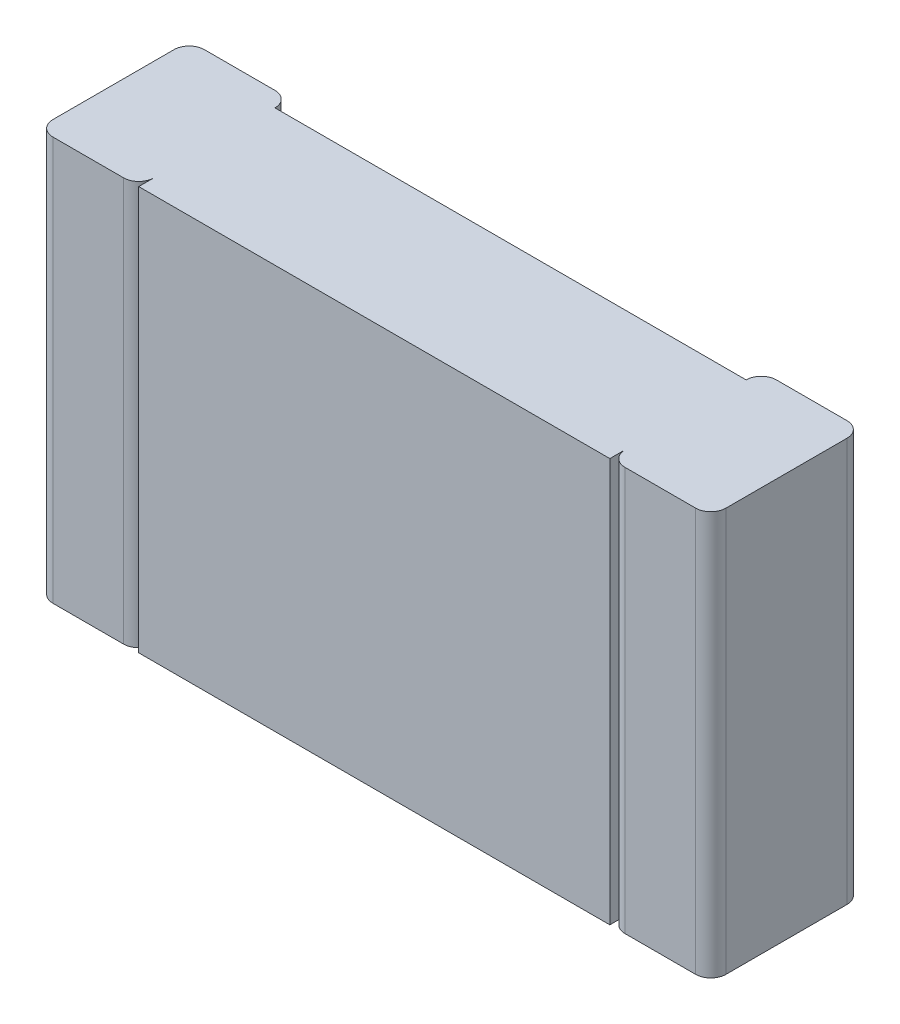
ISO-10303-21;
HEADER;
FILE_DESCRIPTION(('STEP AP214'),'2;1');
FILE_NAME('part.step','',(''),(''),'','','');
FILE_SCHEMA(('AUTOMOTIVE_DESIGN { 1 0 10303 214 1 1 1 1 }'));
ENDSEC;
DATA;
#1=APPLICATION_CONTEXT('core data for automotive mechanical design processes');
#2=APPLICATION_PROTOCOL_DEFINITION('international standard','automotive_design',2000,#1);
#3=PRODUCT_CONTEXT('',#1,'mechanical');
#4=PRODUCT('Part','Part','',(#3));
#5=PRODUCT_RELATED_PRODUCT_CATEGORY('part','',(#4));
#6=PRODUCT_DEFINITION_FORMATION('','',#4);
#7=PRODUCT_DEFINITION_CONTEXT('part definition',#1,'design');
#8=PRODUCT_DEFINITION('design','',#6,#7);
#9=PRODUCT_DEFINITION_SHAPE('','',#8);
#10=(LENGTH_UNIT() NAMED_UNIT(*) SI_UNIT(.MILLI.,.METRE.));
#11=(NAMED_UNIT(*) PLANE_ANGLE_UNIT() SI_UNIT($,.RADIAN.));
#12=(NAMED_UNIT(*) SI_UNIT($,.STERADIAN.) SOLID_ANGLE_UNIT());
#13=UNCERTAINTY_MEASURE_WITH_UNIT(LENGTH_MEASURE(1.E-05),#10,'distance_accuracy_value','');
#14=(GEOMETRIC_REPRESENTATION_CONTEXT(3) GLOBAL_UNCERTAINTY_ASSIGNED_CONTEXT((#13)) GLOBAL_UNIT_ASSIGNED_CONTEXT((#10,
#11,#12)) REPRESENTATION_CONTEXT('',''));
#15=CARTESIAN_POINT('',(0.,0.,0.));
#16=DIRECTION('',(0.,0.,1.));
#17=DIRECTION('',(1.,0.,0.));
#18=AXIS2_PLACEMENT_3D('',#15,#16,#17);
#19=CARTESIAN_POINT('',(-0.7,-0.6,0.405));
#20=DIRECTION('',(1.,0.,0.));
#21=DIRECTION('',(0.,0.,-1.));
#22=AXIS2_PLACEMENT_3D('',#19,#20,#21);
#23=PLANE('',#22);
#24=DIRECTION('',(0.,0.,-1.));
#25=VECTOR('',#24,1.);
#26=CARTESIAN_POINT('',(-0.7,0.6,0.405));
#27=LINE('',#26,#25);
#28=CARTESIAN_POINT('',(-0.7,0.6,0.405));
#29=VERTEX_POINT('',#28);
#30=CARTESIAN_POINT('',(-0.7,0.6,0.45));
#31=VERTEX_POINT('',#30);
#32=EDGE_CURVE('E197',#29,#31,#27,.F.);
#33=ORIENTED_EDGE('',*,*,#32,.F.);
#34=DIRECTION('',(0.,1.,0.));
#35=VECTOR('',#34,1.);
#36=CARTESIAN_POINT('',(-0.7,-0.6,0.405));
#37=LINE('',#36,#35);
#38=CARTESIAN_POINT('',(-0.7,-0.6,0.405));
#39=VERTEX_POINT('',#38);
#40=EDGE_CURVE('E182',#39,#29,#37,.T.);
#41=ORIENTED_EDGE('',*,*,#40,.F.);
#42=DIRECTION('',(0.,0.,-1.));
#43=VECTOR('',#42,1.);
#44=CARTESIAN_POINT('',(-0.7,-0.6,0.405));
#45=LINE('',#44,#43);
#46=CARTESIAN_POINT('',(-0.7,-0.6,0.45));
#47=VERTEX_POINT('',#46);
#48=EDGE_CURVE('E200',#47,#39,#45,.T.);
#49=ORIENTED_EDGE('',*,*,#48,.F.);
#50=DIRECTION('',(0.,1.,0.));
#51=VECTOR('',#50,1.);
#52=CARTESIAN_POINT('',(-0.7,-0.6,0.45));
#53=LINE('',#52,#51);
#54=EDGE_CURVE('E188',#31,#47,#53,.F.);
#55=ORIENTED_EDGE('',*,*,#54,.F.);
#56=EDGE_LOOP('',(#33,#41,#49,#55));
#57=FACE_BOUND('',#56,.T.);
#58=ADVANCED_FACE('F17',(#57),#23,.F.);
#59=CARTESIAN_POINT('',(0.7,-0.6,0.405));
#60=DIRECTION('',(1.,0.,0.));
#61=DIRECTION('',(0.,0.,-1.));
#62=AXIS2_PLACEMENT_3D('',#59,#60,#61);
#63=PLANE('',#62);
#64=DIRECTION('',(0.,0.,-1.));
#65=VECTOR('',#64,1.);
#66=CARTESIAN_POINT('',(0.7,0.6,0.405));
#67=LINE('',#66,#65);
#68=CARTESIAN_POINT('',(0.7,0.6,0.405));
#69=VERTEX_POINT('',#68);
#70=CARTESIAN_POINT('',(0.7,0.6,0.45));
#71=VERTEX_POINT('',#70);
#72=EDGE_CURVE('E143',#69,#71,#67,.F.);
#73=ORIENTED_EDGE('',*,*,#72,.T.);
#74=DIRECTION('',(0.,1.,0.));
#75=VECTOR('',#74,1.);
#76=CARTESIAN_POINT('',(0.7,-0.6,0.45));
#77=LINE('',#76,#75);
#78=CARTESIAN_POINT('',(0.7,-0.6,0.45));
#79=VERTEX_POINT('',#78);
#80=EDGE_CURVE('E177',#79,#71,#77,.T.);
#81=ORIENTED_EDGE('',*,*,#80,.F.);
#82=DIRECTION('',(0.,0.,-1.));
#83=VECTOR('',#82,1.);
#84=CARTESIAN_POINT('',(0.7,-0.6,0.405));
#85=LINE('',#84,#83);
#86=CARTESIAN_POINT('',(0.7,-0.6,0.405));
#87=VERTEX_POINT('',#86);
#88=EDGE_CURVE('E193',#79,#87,#85,.T.);
#89=ORIENTED_EDGE('',*,*,#88,.T.);
#90=DIRECTION('',(0.,1.,0.));
#91=VECTOR('',#90,1.);
#92=CARTESIAN_POINT('',(0.7,-0.6,0.405));
#93=LINE('',#92,#91);
#94=EDGE_CURVE('E174',#69,#87,#93,.F.);
#95=ORIENTED_EDGE('',*,*,#94,.F.);
#96=EDGE_LOOP('',(#73,#81,#89,#95));
#97=FACE_BOUND('',#96,.T.);
#98=ADVANCED_FACE('F419',(#97),#63,.T.);
#99=CARTESIAN_POINT('',(-0.955,-0.6,0.045));
#100=DIRECTION('',(0.,1.,0.));
#101=DIRECTION('',(0.,0.,1.));
#102=AXIS2_PLACEMENT_3D('',#99,#100,#101);
#103=CYLINDRICAL_SURFACE('',#102,0.045);
#104=DIRECTION('',(0.,1.,0.));
#105=VECTOR('',#104,1.);
#106=CARTESIAN_POINT('',(-0.955,-0.6,0.));
#107=LINE('',#106,#105);
#108=CARTESIAN_POINT('',(-0.955,0.6,0.));
#109=VERTEX_POINT('',#108);
#110=CARTESIAN_POINT('',(-0.955,-0.6,0.));
#111=VERTEX_POINT('',#110);
#112=EDGE_CURVE('E129',#109,#111,#107,.F.);
#113=ORIENTED_EDGE('',*,*,#112,.T.);
#114=CARTESIAN_POINT('',(-0.955,-0.6,0.045));
#115=DIRECTION('',(0.,1.,0.));
#116=DIRECTION('',(0.,0.,1.));
#117=AXIS2_PLACEMENT_3D('',#114,#115,#116);
#118=CIRCLE('',#117,0.045);
#119=CARTESIAN_POINT('',(-1.,-0.6,0.045));
#120=VERTEX_POINT('',#119);
#121=EDGE_CURVE('E20',#111,#120,#118,.T.);
#122=ORIENTED_EDGE('',*,*,#121,.T.);
#123=DIRECTION('',(0.,1.,0.));
#124=VECTOR('',#123,1.);
#125=CARTESIAN_POINT('',(-1.,-0.6,0.045));
#126=LINE('',#125,#124);
#127=CARTESIAN_POINT('',(-1.,0.6,0.045));
#128=VERTEX_POINT('',#127);
#129=EDGE_CURVE('E136',#120,#128,#126,.T.);
#130=ORIENTED_EDGE('',*,*,#129,.T.);
#131=CARTESIAN_POINT('',(-0.955,0.6,0.045));
#132=DIRECTION('',(0.,1.,0.));
#133=DIRECTION('',(0.,0.,1.));
#134=AXIS2_PLACEMENT_3D('',#131,#132,#133);
#135=CIRCLE('',#134,0.045);
#136=EDGE_CURVE('E250',#109,#128,#135,.T.);
#137=ORIENTED_EDGE('',*,*,#136,.F.);
#138=EDGE_LOOP('',(#113,#122,#130,#137));
#139=FACE_BOUND('',#138,.T.);
#140=ADVANCED_FACE('F154',(#139),#103,.T.);
#141=CARTESIAN_POINT('',(-1.,-0.6,0.));
#142=DIRECTION('',(1.,0.,0.));
#143=DIRECTION('',(0.,0.,-1.));
#144=AXIS2_PLACEMENT_3D('',#141,#142,#143);
#145=PLANE('',#144);
#146=DIRECTION('',(0.,0.,1.));
#147=VECTOR('',#146,1.);
#148=CARTESIAN_POINT('',(-1.,0.6,0.));
#149=LINE('',#148,#147);
#150=CARTESIAN_POINT('',(-1.,0.6,0.405));
#151=VERTEX_POINT('',#150);
#152=EDGE_CURVE('E141',#128,#151,#149,.T.);
#153=ORIENTED_EDGE('',*,*,#152,.F.);
#154=ORIENTED_EDGE('',*,*,#129,.F.);
#155=DIRECTION('',(0.,0.,1.));
#156=VECTOR('',#155,1.);
#157=CARTESIAN_POINT('',(-1.,-0.6,0.));
#158=LINE('',#157,#156);
#159=CARTESIAN_POINT('',(-1.,-0.6,0.405));
#160=VERTEX_POINT('',#159);
#161=EDGE_CURVE('E140',#120,#160,#158,.T.);
#162=ORIENTED_EDGE('',*,*,#161,.T.);
#163=DIRECTION('',(0.,1.,0.));
#164=VECTOR('',#163,1.);
#165=CARTESIAN_POINT('',(-1.,-0.6,0.405));
#166=LINE('',#165,#164);
#167=EDGE_CURVE('E142',#151,#160,#166,.F.);
#168=ORIENTED_EDGE('',*,*,#167,.F.);
#169=EDGE_LOOP('',(#153,#154,#162,#168));
#170=FACE_BOUND('',#169,.T.);
#171=ADVANCED_FACE('F138',(#170),#145,.F.);
#172=CARTESIAN_POINT('',(-0.955,-0.6,0.405));
#173=DIRECTION('',(0.,1.,0.));
#174=DIRECTION('',(0.,0.,1.));
#175=AXIS2_PLACEMENT_3D('',#172,#173,#174);
#176=CYLINDRICAL_SURFACE('',#175,0.045);
#177=CARTESIAN_POINT('',(-0.955,0.6,0.405));
#178=DIRECTION('',(0.,1.,0.));
#179=DIRECTION('',(0.,0.,1.));
#180=AXIS2_PLACEMENT_3D('',#177,#178,#179);
#181=CIRCLE('',#180,0.045);
#182=CARTESIAN_POINT('',(-0.955,0.6,0.45));
#183=VERTEX_POINT('',#182);
#184=EDGE_CURVE('E248',#151,#183,#181,.T.);
#185=ORIENTED_EDGE('',*,*,#184,.F.);
#186=ORIENTED_EDGE('',*,*,#167,.T.);
#187=CARTESIAN_POINT('',(-0.955,-0.6,0.405));
#188=DIRECTION('',(0.,1.,0.));
#189=DIRECTION('',(0.,0.,1.));
#190=AXIS2_PLACEMENT_3D('',#187,#188,#189);
#191=CIRCLE('',#190,0.045);
#192=CARTESIAN_POINT('',(-0.955,-0.6,0.45));
#193=VERTEX_POINT('',#192);
#194=EDGE_CURVE('E152',#160,#193,#191,.T.);
#195=ORIENTED_EDGE('',*,*,#194,.T.);
#196=DIRECTION('',(0.,1.,0.));
#197=VECTOR('',#196,1.);
#198=CARTESIAN_POINT('',(-0.955,-0.6,0.45));
#199=LINE('',#198,#197);
#200=EDGE_CURVE('E186',#183,#193,#199,.F.);
#201=ORIENTED_EDGE('',*,*,#200,.F.);
#202=EDGE_LOOP('',(#185,#186,#195,#201));
#203=FACE_BOUND('',#202,.T.);
#204=ADVANCED_FACE('F449',(#203),#176,.T.);
#205=CARTESIAN_POINT('',(-1.,-0.6,0.45));
#206=DIRECTION('',(0.,0.,1.));
#207=DIRECTION('',(1.,0.,0.));
#208=AXIS2_PLACEMENT_3D('',#205,#206,#207);
#209=PLANE('',#208);
#210=DIRECTION('',(1.,0.,0.));
#211=VECTOR('',#210,1.);
#212=CARTESIAN_POINT('',(-1.,-0.6,0.45));
#213=LINE('',#212,#211);
#214=CARTESIAN_POINT('',(-0.745,-0.6,0.45));
#215=VERTEX_POINT('',#214);
#216=EDGE_CURVE('E265',#193,#215,#213,.T.);
#217=ORIENTED_EDGE('',*,*,#216,.T.);
#218=DIRECTION('',(0.,1.,0.));
#219=VECTOR('',#218,1.);
#220=CARTESIAN_POINT('',(-0.745,-0.6,0.45));
#221=LINE('',#220,#219);
#222=CARTESIAN_POINT('',(-0.745,0.6,0.45));
#223=VERTEX_POINT('',#222);
#224=EDGE_CURVE('E185',#223,#215,#221,.F.);
#225=ORIENTED_EDGE('',*,*,#224,.F.);
#226=DIRECTION('',(1.,0.,0.));
#227=VECTOR('',#226,1.);
#228=CARTESIAN_POINT('',(-1.,0.6,0.45));
#229=LINE('',#228,#227);
#230=EDGE_CURVE('E247',#183,#223,#229,.T.);
#231=ORIENTED_EDGE('',*,*,#230,.F.);
#232=ORIENTED_EDGE('',*,*,#200,.T.);
#233=EDGE_LOOP('',(#217,#225,#231,#232));
#234=FACE_BOUND('',#233,.T.);
#235=ADVANCED_FACE('F456',(#234),#209,.T.);
#236=CARTESIAN_POINT('',(-0.745,-0.6,0.405));
#237=DIRECTION('',(0.,1.,0.));
#238=DIRECTION('',(0.,0.,1.));
#239=AXIS2_PLACEMENT_3D('',#236,#237,#238);
#240=CYLINDRICAL_SURFACE('',#239,0.045);
#241=ORIENTED_EDGE('',*,*,#224,.T.);
#242=CARTESIAN_POINT('',(-0.745,-0.6,0.405));
#243=DIRECTION('',(0.,1.,0.));
#244=DIRECTION('',(0.,0.,1.));
#245=AXIS2_PLACEMENT_3D('',#242,#243,#244);
#246=CIRCLE('',#245,0.045);
#247=EDGE_CURVE('E221',#215,#39,#246,.T.);
#248=ORIENTED_EDGE('',*,*,#247,.T.);
#249=ORIENTED_EDGE('',*,*,#40,.T.);
#250=CARTESIAN_POINT('',(-0.745,0.6,0.405));
#251=DIRECTION('',(0.,1.,0.));
#252=DIRECTION('',(0.,0.,1.));
#253=AXIS2_PLACEMENT_3D('',#250,#251,#252);
#254=CIRCLE('',#253,0.045);
#255=EDGE_CURVE('E216',#223,#29,#254,.T.);
#256=ORIENTED_EDGE('',*,*,#255,.F.);
#257=EDGE_LOOP('',(#241,#248,#249,#256));
#258=FACE_BOUND('',#257,.T.);
#259=ADVANCED_FACE('F409',(#258),#240,.T.);
#260=CARTESIAN_POINT('',(-0.7,-0.6,0.45));
#261=DIRECTION('',(0.,0.,1.));
#262=DIRECTION('',(1.,0.,0.));
#263=AXIS2_PLACEMENT_3D('',#260,#261,#262);
#264=PLANE('',#263);
#265=ORIENTED_EDGE('',*,*,#80,.T.);
#266=DIRECTION('',(1.,0.,0.));
#267=VECTOR('',#266,1.);
#268=CARTESIAN_POINT('',(-0.7,0.6,0.45));
#269=LINE('',#268,#267);
#270=EDGE_CURVE('E212',#31,#71,#269,.T.);
#271=ORIENTED_EDGE('',*,*,#270,.F.);
#272=ORIENTED_EDGE('',*,*,#54,.T.);
#273=DIRECTION('',(1.,0.,0.));
#274=VECTOR('',#273,1.);
#275=CARTESIAN_POINT('',(-0.7,-0.6,0.45));
#276=LINE('',#275,#274);
#277=EDGE_CURVE('E181',#47,#79,#276,.T.);
#278=ORIENTED_EDGE('',*,*,#277,.T.);
#279=EDGE_LOOP('',(#265,#271,#272,#278));
#280=FACE_BOUND('',#279,.T.);
#281=ADVANCED_FACE('F377',(#280),#264,.T.);
#282=CARTESIAN_POINT('',(0.745,-0.6,0.405));
#283=DIRECTION('',(0.,1.,0.));
#284=DIRECTION('',(0.,0.,1.));
#285=AXIS2_PLACEMENT_3D('',#282,#283,#284);
#286=CYLINDRICAL_SURFACE('',#285,0.045);
#287=CARTESIAN_POINT('',(0.745,0.6,0.405));
#288=DIRECTION('',(0.,1.,0.));
#289=DIRECTION('',(0.,0.,1.));
#290=AXIS2_PLACEMENT_3D('',#287,#288,#289);
#291=CIRCLE('',#290,0.045);
#292=CARTESIAN_POINT('',(0.745,0.6,0.45));
#293=VERTEX_POINT('',#292);
#294=EDGE_CURVE('E243',#69,#293,#291,.T.);
#295=ORIENTED_EDGE('',*,*,#294,.F.);
#296=ORIENTED_EDGE('',*,*,#94,.T.);
#297=CARTESIAN_POINT('',(0.745,-0.6,0.405));
#298=DIRECTION('',(0.,1.,0.));
#299=DIRECTION('',(0.,0.,1.));
#300=AXIS2_PLACEMENT_3D('',#297,#298,#299);
#301=CIRCLE('',#300,0.045);
#302=CARTESIAN_POINT('',(0.745,-0.6,0.45));
#303=VERTEX_POINT('',#302);
#304=EDGE_CURVE('E261',#87,#303,#301,.T.);
#305=ORIENTED_EDGE('',*,*,#304,.T.);
#306=DIRECTION('',(0.,1.,0.));
#307=VECTOR('',#306,1.);
#308=CARTESIAN_POINT('',(0.745,-0.6,0.45));
#309=LINE('',#308,#307);
#310=EDGE_CURVE('E172',#293,#303,#309,.F.);
#311=ORIENTED_EDGE('',*,*,#310,.F.);
#312=EDGE_LOOP('',(#295,#296,#305,#311));
#313=FACE_BOUND('',#312,.T.);
#314=ADVANCED_FACE('F408',(#313),#286,.T.);
#315=CARTESIAN_POINT('',(0.7,-0.6,0.45));
#316=DIRECTION('',(0.,0.,1.));
#317=DIRECTION('',(1.,0.,0.));
#318=AXIS2_PLACEMENT_3D('',#315,#316,#317);
#319=PLANE('',#318);
#320=DIRECTION('',(1.,0.,0.));
#321=VECTOR('',#320,1.);
#322=CARTESIAN_POINT('',(0.7,-0.6,0.45));
#323=LINE('',#322,#321);
#324=CARTESIAN_POINT('',(0.955,-0.6,0.45));
#325=VERTEX_POINT('',#324);
#326=EDGE_CURVE('E260',#303,#325,#323,.T.);
#327=ORIENTED_EDGE('',*,*,#326,.T.);
#328=DIRECTION('',(0.,1.,0.));
#329=VECTOR('',#328,1.);
#330=CARTESIAN_POINT('',(0.955,-0.6,0.45));
#331=LINE('',#330,#329);
#332=CARTESIAN_POINT('',(0.955,0.6,0.45));
#333=VERTEX_POINT('',#332);
#334=EDGE_CURVE('E170',#333,#325,#331,.F.);
#335=ORIENTED_EDGE('',*,*,#334,.F.);
#336=DIRECTION('',(1.,0.,0.));
#337=VECTOR('',#336,1.);
#338=CARTESIAN_POINT('',(0.7,0.6,0.45));
#339=LINE('',#338,#337);
#340=EDGE_CURVE('E242',#293,#333,#339,.T.);
#341=ORIENTED_EDGE('',*,*,#340,.F.);
#342=ORIENTED_EDGE('',*,*,#310,.T.);
#343=EDGE_LOOP('',(#327,#335,#341,#342));
#344=FACE_BOUND('',#343,.T.);
#345=ADVANCED_FACE('F474',(#344),#319,.T.);
#346=CARTESIAN_POINT('',(0.955,-0.6,0.405));
#347=DIRECTION('',(0.,1.,0.));
#348=DIRECTION('',(0.,0.,1.));
#349=AXIS2_PLACEMENT_3D('',#346,#347,#348);
#350=CYLINDRICAL_SURFACE('',#349,0.045);
#351=ORIENTED_EDGE('',*,*,#334,.T.);
#352=CARTESIAN_POINT('',(0.955,-0.6,0.405));
#353=DIRECTION('',(0.,1.,0.));
#354=DIRECTION('',(0.,0.,1.));
#355=AXIS2_PLACEMENT_3D('',#352,#353,#354);
#356=CIRCLE('',#355,0.045);
#357=CARTESIAN_POINT('',(1.,-0.6,0.405));
#358=VERTEX_POINT('',#357);
#359=EDGE_CURVE('E257',#325,#358,#356,.T.);
#360=ORIENTED_EDGE('',*,*,#359,.T.);
#361=DIRECTION('',(0.,1.,0.));
#362=VECTOR('',#361,1.);
#363=CARTESIAN_POINT('',(1.,-0.6,0.405));
#364=LINE('',#363,#362);
#365=CARTESIAN_POINT('',(1.,0.6,0.405));
#366=VERTEX_POINT('',#365);
#367=EDGE_CURVE('E168',#366,#358,#364,.F.);
#368=ORIENTED_EDGE('',*,*,#367,.F.);
#369=CARTESIAN_POINT('',(0.955,0.6,0.405));
#370=DIRECTION('',(0.,1.,0.));
#371=DIRECTION('',(0.,0.,1.));
#372=AXIS2_PLACEMENT_3D('',#369,#370,#371);
#373=CIRCLE('',#372,0.045);
#374=EDGE_CURVE('E240',#333,#366,#373,.T.);
#375=ORIENTED_EDGE('',*,*,#374,.F.);
#376=EDGE_LOOP('',(#351,#360,#368,#375));
#377=FACE_BOUND('',#376,.T.);
#378=ADVANCED_FACE('F481',(#377),#350,.T.);
#379=CARTESIAN_POINT('',(1.,-0.6,0.));
#380=DIRECTION('',(1.,0.,0.));
#381=DIRECTION('',(0.,0.,-1.));
#382=AXIS2_PLACEMENT_3D('',#379,#380,#381);
#383=PLANE('',#382);
#384=DIRECTION('',(0.,0.,1.));
#385=VECTOR('',#384,1.);
#386=CARTESIAN_POINT('',(1.,0.6,0.));
#387=LINE('',#386,#385);
#388=CARTESIAN_POINT('',(1.,0.6,0.045));
#389=VERTEX_POINT('',#388);
#390=EDGE_CURVE('E239',#366,#389,#387,.F.);
#391=ORIENTED_EDGE('',*,*,#390,.F.);
#392=ORIENTED_EDGE('',*,*,#367,.T.);
#393=DIRECTION('',(0.,0.,1.));
#394=VECTOR('',#393,1.);
#395=CARTESIAN_POINT('',(1.,-0.6,0.));
#396=LINE('',#395,#394);
#397=CARTESIAN_POINT('',(1.,-0.6,0.045));
#398=VERTEX_POINT('',#397);
#399=EDGE_CURVE('E256',#358,#398,#396,.F.);
#400=ORIENTED_EDGE('',*,*,#399,.T.);
#401=DIRECTION('',(0.,1.,0.));
#402=VECTOR('',#401,1.);
#403=CARTESIAN_POINT('',(1.,-0.6,0.045));
#404=LINE('',#403,#402);
#405=EDGE_CURVE('E159',#389,#398,#404,.F.);
#406=ORIENTED_EDGE('',*,*,#405,.F.);
#407=EDGE_LOOP('',(#391,#392,#400,#406));
#408=FACE_BOUND('',#407,.T.);
#409=ADVANCED_FACE('F300',(#408),#383,.T.);
#410=CARTESIAN_POINT('',(0.955,-0.6,0.045));
#411=DIRECTION('',(0.,1.,0.));
#412=DIRECTION('',(0.,0.,1.));
#413=AXIS2_PLACEMENT_3D('',#410,#411,#412);
#414=CYLINDRICAL_SURFACE('',#413,0.045);
#415=CARTESIAN_POINT('',(0.955,0.6,0.045));
#416=DIRECTION('',(0.,1.,0.));
#417=DIRECTION('',(0.,0.,1.));
#418=AXIS2_PLACEMENT_3D('',#415,#416,#417);
#419=CIRCLE('',#418,0.045);
#420=CARTESIAN_POINT('',(0.955,0.6,0.));
#421=VERTEX_POINT('',#420);
#422=EDGE_CURVE('E236',#389,#421,#419,.T.);
#423=ORIENTED_EDGE('',*,*,#422,.F.);
#424=ORIENTED_EDGE('',*,*,#405,.T.);
#425=CARTESIAN_POINT('',(0.955,-0.6,0.045));
#426=DIRECTION('',(0.,1.,0.));
#427=DIRECTION('',(0.,0.,1.));
#428=AXIS2_PLACEMENT_3D('',#425,#426,#427);
#429=CIRCLE('',#428,0.045);
#430=CARTESIAN_POINT('',(0.955,-0.6,0.));
#431=VERTEX_POINT('',#430);
#432=EDGE_CURVE('E253',#398,#431,#429,.T.);
#433=ORIENTED_EDGE('',*,*,#432,.T.);
#434=DIRECTION('',(0.,1.,0.));
#435=VECTOR('',#434,1.);
#436=CARTESIAN_POINT('',(0.955,-0.6,0.));
#437=LINE('',#436,#435);
#438=EDGE_CURVE('E178',#431,#421,#437,.T.);
#439=ORIENTED_EDGE('',*,*,#438,.T.);
#440=EDGE_LOOP('',(#423,#424,#433,#439));
#441=FACE_BOUND('',#440,.T.);
#442=ADVANCED_FACE('F304',(#441),#414,.T.);
#443=CARTESIAN_POINT('',(-1.,-0.6,0.));
#444=DIRECTION('',(0.,0.,1.));
#445=DIRECTION('',(1.,0.,0.));
#446=AXIS2_PLACEMENT_3D('',#443,#444,#445);
#447=PLANE('',#446);
#448=DIRECTION('',(1.,0.,0.));
#449=VECTOR('',#448,1.);
#450=CARTESIAN_POINT('',(-1.,-0.6,0.));
#451=LINE('',#450,#449);
#452=CARTESIAN_POINT('',(-0.745,-0.6,0.));
#453=VERTEX_POINT('',#452);
#454=EDGE_CURVE('E155',#453,#111,#451,.F.);
#455=ORIENTED_EDGE('',*,*,#454,.T.);
#456=ORIENTED_EDGE('',*,*,#112,.F.);
#457=DIRECTION('',(1.,0.,0.));
#458=VECTOR('',#457,1.);
#459=CARTESIAN_POINT('',(-1.,0.6,0.));
#460=LINE('',#459,#458);
#461=CARTESIAN_POINT('',(-0.745,0.6,0.));
#462=VERTEX_POINT('',#461);
#463=EDGE_CURVE('E252',#462,#109,#460,.F.);
#464=ORIENTED_EDGE('',*,*,#463,.F.);
#465=DIRECTION('',(0.,1.,0.));
#466=VECTOR('',#465,1.);
#467=CARTESIAN_POINT('',(-0.745,-0.6,0.));
#468=LINE('',#467,#466);
#469=EDGE_CURVE('E163',#453,#462,#468,.T.);
#470=ORIENTED_EDGE('',*,*,#469,.F.);
#471=EDGE_LOOP('',(#455,#456,#464,#470));
#472=FACE_BOUND('',#471,.T.);
#473=ADVANCED_FACE('F321',(#472),#447,.F.);
#474=CARTESIAN_POINT('',(0.7,-0.6,0.));
#475=DIRECTION('',(0.,0.,1.));
#476=DIRECTION('',(1.,0.,0.));
#477=AXIS2_PLACEMENT_3D('',#474,#475,#476);
#478=PLANE('',#477);
#479=DIRECTION('',(1.,0.,0.));
#480=VECTOR('',#479,1.);
#481=CARTESIAN_POINT('',(0.7,-0.6,0.));
#482=LINE('',#481,#480);
#483=CARTESIAN_POINT('',(0.745,-0.6,0.));
#484=VERTEX_POINT('',#483);
#485=EDGE_CURVE('E180',#431,#484,#482,.F.);
#486=ORIENTED_EDGE('',*,*,#485,.T.);
#487=DIRECTION('',(0.,1.,0.));
#488=VECTOR('',#487,1.);
#489=CARTESIAN_POINT('',(0.745,-0.6,0.));
#490=LINE('',#489,#488);
#491=CARTESIAN_POINT('',(0.745,0.6,0.));
#492=VERTEX_POINT('',#491);
#493=EDGE_CURVE('E231',#492,#484,#490,.F.);
#494=ORIENTED_EDGE('',*,*,#493,.F.);
#495=DIRECTION('',(1.,0.,0.));
#496=VECTOR('',#495,1.);
#497=CARTESIAN_POINT('',(0.7,0.6,0.));
#498=LINE('',#497,#496);
#499=EDGE_CURVE('E215',#421,#492,#498,.F.);
#500=ORIENTED_EDGE('',*,*,#499,.F.);
#501=ORIENTED_EDGE('',*,*,#438,.F.);
#502=EDGE_LOOP('',(#486,#494,#500,#501));
#503=FACE_BOUND('',#502,.T.);
#504=ADVANCED_FACE('F307',(#503),#478,.F.);
#505=CARTESIAN_POINT('',(-0.745,-0.6,0.045));
#506=DIRECTION('',(0.,1.,0.));
#507=DIRECTION('',(0.,0.,1.));
#508=AXIS2_PLACEMENT_3D('',#505,#506,#507);
#509=CYLINDRICAL_SURFACE('',#508,0.045);
#510=CARTESIAN_POINT('',(-0.745,0.6,0.045));
#511=DIRECTION('',(0.,1.,0.));
#512=DIRECTION('',(0.,0.,1.));
#513=AXIS2_PLACEMENT_3D('',#510,#511,#512);
#514=CIRCLE('',#513,0.045);
#515=CARTESIAN_POINT('',(-0.7,0.6,0.045));
#516=VERTEX_POINT('',#515);
#517=EDGE_CURVE('E165',#462,#516,#514,.F.);
#518=ORIENTED_EDGE('',*,*,#517,.T.);
#519=DIRECTION('',(0.,1.,0.));
#520=VECTOR('',#519,1.);
#521=CARTESIAN_POINT('',(-0.7,-0.6,0.045));
#522=LINE('',#521,#520);
#523=CARTESIAN_POINT('',(-0.7,-0.6,0.045));
#524=VERTEX_POINT('',#523);
#525=EDGE_CURVE('E230',#516,#524,#522,.F.);
#526=ORIENTED_EDGE('',*,*,#525,.T.);
#527=CARTESIAN_POINT('',(-0.745,-0.6,0.045));
#528=DIRECTION('',(0.,1.,0.));
#529=DIRECTION('',(0.,0.,1.));
#530=AXIS2_PLACEMENT_3D('',#527,#528,#529);
#531=CIRCLE('',#530,0.045);
#532=EDGE_CURVE('E166',#524,#453,#531,.T.);
#533=ORIENTED_EDGE('',*,*,#532,.T.);
#534=ORIENTED_EDGE('',*,*,#469,.T.);
#535=EDGE_LOOP('',(#518,#526,#533,#534));
#536=FACE_BOUND('',#535,.T.);
#537=ADVANCED_FACE('F320',(#536),#509,.T.);
#538=CARTESIAN_POINT('',(-0.955,-0.6,0.045));
#539=DIRECTION('',(0.,1.,0.));
#540=DIRECTION('',(0.,0.,1.));
#541=AXIS2_PLACEMENT_3D('',#538,#539,#540);
#542=PLANE('',#541);
#543=DIRECTION('',(1.,0.,0.));
#544=VECTOR('',#543,1.);
#545=CARTESIAN_POINT('',(-0.955,-0.6,0.045));
#546=LINE('',#545,#544);
#547=CARTESIAN_POINT('',(0.7,-0.6,0.045));
#548=VERTEX_POINT('',#547);
#549=EDGE_CURVE('E272',#524,#548,#546,.T.);
#550=ORIENTED_EDGE('',*,*,#549,.T.);
#551=CARTESIAN_POINT('',(0.745,-0.6,0.045));
#552=DIRECTION('',(0.,1.,0.));
#553=DIRECTION('',(0.,0.,1.));
#554=AXIS2_PLACEMENT_3D('',#551,#552,#553);
#555=CIRCLE('',#554,0.045);
#556=EDGE_CURVE('E228',#484,#548,#555,.T.);
#557=ORIENTED_EDGE('',*,*,#556,.F.);
#558=ORIENTED_EDGE('',*,*,#485,.F.);
#559=ORIENTED_EDGE('',*,*,#432,.F.);
#560=ORIENTED_EDGE('',*,*,#399,.F.);
#561=ORIENTED_EDGE('',*,*,#359,.F.);
#562=ORIENTED_EDGE('',*,*,#326,.F.);
#563=ORIENTED_EDGE('',*,*,#304,.F.);
#564=ORIENTED_EDGE('',*,*,#88,.F.);
#565=ORIENTED_EDGE('',*,*,#277,.F.);
#566=ORIENTED_EDGE('',*,*,#48,.T.);
#567=ORIENTED_EDGE('',*,*,#247,.F.);
#568=ORIENTED_EDGE('',*,*,#216,.F.);
#569=ORIENTED_EDGE('',*,*,#194,.F.);
#570=ORIENTED_EDGE('',*,*,#161,.F.);
#571=ORIENTED_EDGE('',*,*,#121,.F.);
#572=ORIENTED_EDGE('',*,*,#454,.F.);
#573=ORIENTED_EDGE('',*,*,#532,.F.);
#574=EDGE_LOOP('',(#550,#557,#558,#559,#560,#561,#562,#563,#564,#565,#566,#567,#568,#569,#570,
#571,#572,#573));
#575=FACE_BOUND('',#574,.T.);
#576=ADVANCED_FACE('F148',(#575),#542,.F.);
#577=CARTESIAN_POINT('',(0.745,-0.6,0.045));
#578=DIRECTION('',(0.,1.,0.));
#579=DIRECTION('',(0.,0.,1.));
#580=AXIS2_PLACEMENT_3D('',#577,#578,#579);
#581=CYLINDRICAL_SURFACE('',#580,0.045);
#582=ORIENTED_EDGE('',*,*,#493,.T.);
#583=ORIENTED_EDGE('',*,*,#556,.T.);
#584=DIRECTION('',(0.,1.,0.));
#585=VECTOR('',#584,1.);
#586=CARTESIAN_POINT('',(0.7,-0.6,0.045));
#587=LINE('',#586,#585);
#588=CARTESIAN_POINT('',(0.7,0.6,0.045));
#589=VERTEX_POINT('',#588);
#590=EDGE_CURVE('E26',#548,#589,#587,.T.);
#591=ORIENTED_EDGE('',*,*,#590,.T.);
#592=CARTESIAN_POINT('',(0.745,0.6,0.045));
#593=DIRECTION('',(0.,1.,0.));
#594=DIRECTION('',(0.,0.,1.));
#595=AXIS2_PLACEMENT_3D('',#592,#593,#594);
#596=CIRCLE('',#595,0.045);
#597=EDGE_CURVE('E34',#589,#492,#596,.F.);
#598=ORIENTED_EDGE('',*,*,#597,.T.);
#599=EDGE_LOOP('',(#582,#583,#591,#598));
#600=FACE_BOUND('',#599,.T.);
#601=ADVANCED_FACE('F313',(#600),#581,.T.);
#602=CARTESIAN_POINT('',(-0.955,0.6,0.045));
#603=DIRECTION('',(0.,1.,0.));
#604=DIRECTION('',(0.,0.,1.));
#605=AXIS2_PLACEMENT_3D('',#602,#603,#604);
#606=PLANE('',#605);
#607=DIRECTION('',(1.,0.,0.));
#608=VECTOR('',#607,1.);
#609=CARTESIAN_POINT('',(-0.955,0.6,0.045));
#610=LINE('',#609,#608);
#611=EDGE_CURVE('E11',#589,#516,#610,.F.);
#612=ORIENTED_EDGE('',*,*,#611,.T.);
#613=ORIENTED_EDGE('',*,*,#517,.F.);
#614=ORIENTED_EDGE('',*,*,#463,.T.);
#615=ORIENTED_EDGE('',*,*,#136,.T.);
#616=ORIENTED_EDGE('',*,*,#152,.T.);
#617=ORIENTED_EDGE('',*,*,#184,.T.);
#618=ORIENTED_EDGE('',*,*,#230,.T.);
#619=ORIENTED_EDGE('',*,*,#255,.T.);
#620=ORIENTED_EDGE('',*,*,#32,.T.);
#621=ORIENTED_EDGE('',*,*,#270,.T.);
#622=ORIENTED_EDGE('',*,*,#72,.F.);
#623=ORIENTED_EDGE('',*,*,#294,.T.);
#624=ORIENTED_EDGE('',*,*,#340,.T.);
#625=ORIENTED_EDGE('',*,*,#374,.T.);
#626=ORIENTED_EDGE('',*,*,#390,.T.);
#627=ORIENTED_EDGE('',*,*,#422,.T.);
#628=ORIENTED_EDGE('',*,*,#499,.T.);
#629=ORIENTED_EDGE('',*,*,#597,.F.);
#630=EDGE_LOOP('',(#612,#613,#614,#615,#616,#617,#618,#619,#620,#621,#622,#623,#624,#625,#626,
#627,#628,#629));
#631=FACE_BOUND('',#630,.T.);
#632=ADVANCED_FACE('F294',(#631),#606,.T.);
#633=CARTESIAN_POINT('',(-0.955,-0.6,0.045));
#634=DIRECTION('',(0.,0.,1.));
#635=DIRECTION('',(1.,0.,0.));
#636=AXIS2_PLACEMENT_3D('',#633,#634,#635);
#637=PLANE('',#636);
#638=ORIENTED_EDGE('',*,*,#590,.F.);
#639=ORIENTED_EDGE('',*,*,#549,.F.);
#640=ORIENTED_EDGE('',*,*,#525,.F.);
#641=ORIENTED_EDGE('',*,*,#611,.F.);
#642=EDGE_LOOP('',(#638,#639,#640,#641));
#643=FACE_BOUND('',#642,.T.);
#644=ADVANCED_FACE('F315',(#643),#637,.F.);
#645=CLOSED_SHELL('',(#58,#98,#140,#171,#204,#235,#259,#281,#314,#345,#378,#409,#442,#473,#504,
#537,#576,#601,#632,#644));
#646=MANIFOLD_SOLID_BREP('B1',#645);
#647=ADVANCED_BREP_SHAPE_REPRESENTATION('',(#18,#646),#14);
#648=SHAPE_DEFINITION_REPRESENTATION(#9,#647);
ENDSEC;
END-ISO-10303-21;
